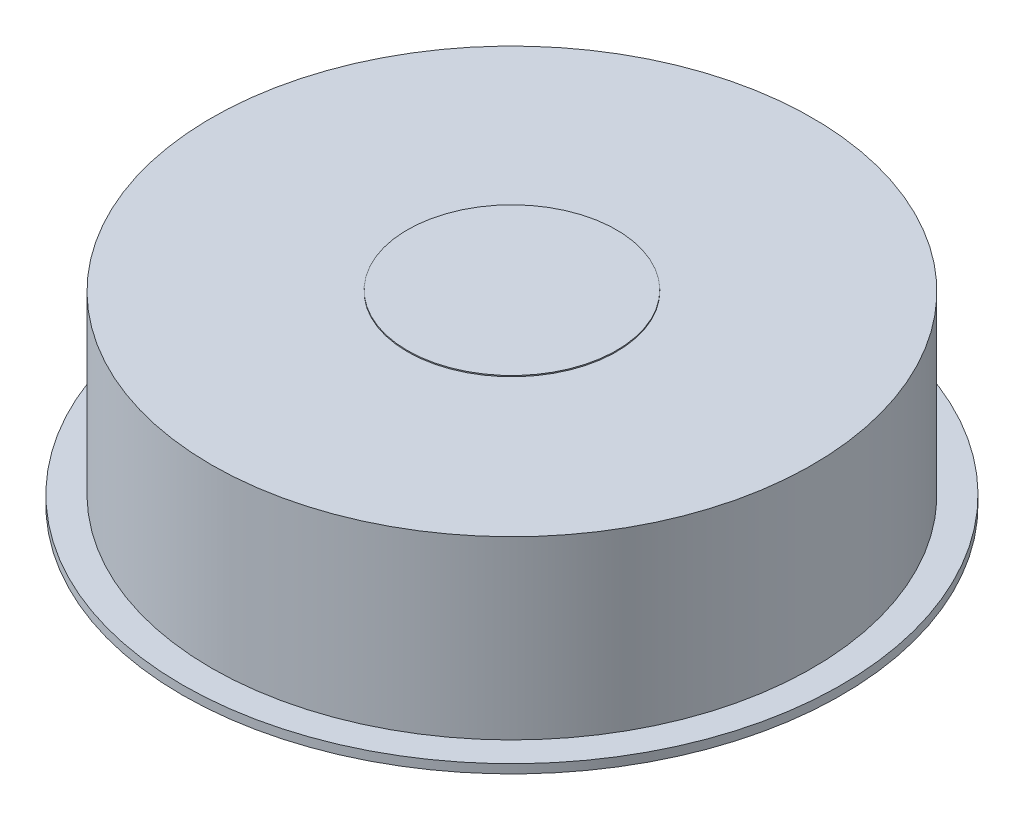
ISO-10303-21;
HEADER;
FILE_DESCRIPTION(('STEP AP214'),'2;1');
FILE_NAME('part.step','',(''),(''),'','','');
FILE_SCHEMA(('AUTOMOTIVE_DESIGN { 1 0 10303 214 1 1 1 1 }'));
ENDSEC;
DATA;
#1=APPLICATION_CONTEXT('core data for automotive mechanical design processes');
#2=APPLICATION_PROTOCOL_DEFINITION('international standard','automotive_design',2000,#1);
#3=PRODUCT_CONTEXT('',#1,'mechanical');
#4=PRODUCT('Part','Part','',(#3));
#5=PRODUCT_RELATED_PRODUCT_CATEGORY('part','',(#4));
#6=PRODUCT_DEFINITION_FORMATION('','',#4);
#7=PRODUCT_DEFINITION_CONTEXT('part definition',#1,'design');
#8=PRODUCT_DEFINITION('design','',#6,#7);
#9=PRODUCT_DEFINITION_SHAPE('','',#8);
#10=(LENGTH_UNIT() NAMED_UNIT(*) SI_UNIT(.MILLI.,.METRE.));
#11=(NAMED_UNIT(*) PLANE_ANGLE_UNIT() SI_UNIT($,.RADIAN.));
#12=(NAMED_UNIT(*) SI_UNIT($,.STERADIAN.) SOLID_ANGLE_UNIT());
#13=UNCERTAINTY_MEASURE_WITH_UNIT(LENGTH_MEASURE(1.E-05),#10,'distance_accuracy_value','');
#14=(GEOMETRIC_REPRESENTATION_CONTEXT(3) GLOBAL_UNCERTAINTY_ASSIGNED_CONTEXT((#13)) GLOBAL_UNIT_ASSIGNED_CONTEXT((#10,
#11,#12)) REPRESENTATION_CONTEXT('',''));
#15=CARTESIAN_POINT('',(0.,0.,0.));
#16=DIRECTION('',(0.,0.,1.));
#17=DIRECTION('',(1.,0.,0.));
#18=AXIS2_PLACEMENT_3D('',#15,#16,#17);
#19=CARTESIAN_POINT('',(0.,11.9141229966181,0.));
#20=DIRECTION('',(0.,-1.,0.));
#21=DIRECTION('',(0.,0.,-1.));
#22=AXIS2_PLACEMENT_3D('',#19,#20,#21);
#23=CYLINDRICAL_SURFACE('',#22,30.65);
#24=CARTESIAN_POINT('',(0.,11.9141229966181,0.));
#25=DIRECTION('',(0.,1.,0.));
#26=DIRECTION('',(0.,0.,1.));
#27=AXIS2_PLACEMENT_3D('',#24,#25,#26);
#28=CIRCLE('',#27,30.65);
#29=CARTESIAN_POINT('',(0.,11.9141229966181,30.65));
#30=VERTEX_POINT('',#29);
#31=EDGE_CURVE('E10',#30,#30,#28,.T.);
#32=ORIENTED_EDGE('',*,*,#31,.F.);
#33=EDGE_LOOP('',(#32));
#34=FACE_BOUND('',#33,.T.);
#35=CARTESIAN_POINT('',(0.,11.0891229966181,0.));
#36=DIRECTION('',(0.,1.,0.));
#37=DIRECTION('',(0.,0.,1.));
#38=AXIS2_PLACEMENT_3D('',#35,#36,#37);
#39=CIRCLE('',#38,30.65);
#40=CARTESIAN_POINT('',(0.,11.0891229966181,30.65));
#41=VERTEX_POINT('',#40);
#42=EDGE_CURVE('E48',#41,#41,#39,.T.);
#43=ORIENTED_EDGE('',*,*,#42,.T.);
#44=EDGE_LOOP('',(#43));
#45=FACE_BOUND('',#44,.T.);
#46=ADVANCED_FACE('F45',(#34,#45),#23,.T.);
#47=CARTESIAN_POINT('',(0.,11.9141229966181,0.));
#48=DIRECTION('',(0.,1.,0.));
#49=DIRECTION('',(0.,0.,1.));
#50=AXIS2_PLACEMENT_3D('',#47,#48,#49);
#51=PLANE('',#50);
#52=CARTESIAN_POINT('',(0.,11.9141229966181,0.));
#53=DIRECTION('',(0.,1.,0.));
#54=DIRECTION('',(0.,0.,1.));
#55=AXIS2_PLACEMENT_3D('',#52,#53,#54);
#56=CIRCLE('',#55,27.945);
#57=CARTESIAN_POINT('',(0.,11.9141229966181,27.945));
#58=VERTEX_POINT('',#57);
#59=EDGE_CURVE('E59',#58,#58,#56,.T.);
#60=ORIENTED_EDGE('',*,*,#59,.F.);
#61=EDGE_LOOP('',(#60));
#62=FACE_BOUND('',#61,.T.);
#63=ORIENTED_EDGE('',*,*,#31,.T.);
#64=EDGE_LOOP('',(#63));
#65=FACE_BOUND('',#64,.T.);
#66=ADVANCED_FACE('F106',(#62,#65),#51,.T.);
#67=CARTESIAN_POINT('',(0.,11.0891229966181,0.));
#68=DIRECTION('',(0.,1.,0.));
#69=DIRECTION('',(0.,0.,1.));
#70=AXIS2_PLACEMENT_3D('',#67,#68,#69);
#71=PLANE('',#70);
#72=CARTESIAN_POINT('',(0.,11.0891229966181,0.));
#73=DIRECTION('',(0.,-1.,0.));
#74=DIRECTION('',(0.,0.,-1.));
#75=AXIS2_PLACEMENT_3D('',#72,#73,#74);
#76=CIRCLE('',#75,25.43);
#77=CARTESIAN_POINT('',(0.,11.0891229966181,-25.43));
#78=VERTEX_POINT('',#77);
#79=EDGE_CURVE('E67',#78,#78,#76,.T.);
#80=ORIENTED_EDGE('',*,*,#79,.F.);
#81=EDGE_LOOP('',(#80));
#82=FACE_BOUND('',#81,.T.);
#83=ORIENTED_EDGE('',*,*,#42,.F.);
#84=EDGE_LOOP('',(#83));
#85=FACE_BOUND('',#84,.T.);
#86=ADVANCED_FACE('F102',(#82,#85),#71,.F.);
#87=CARTESIAN_POINT('',(0.,28.2816229966181,0.));
#88=DIRECTION('',(0.,-1.,0.));
#89=DIRECTION('',(0.,0.,-1.));
#90=AXIS2_PLACEMENT_3D('',#87,#88,#89);
#91=CYLINDRICAL_SURFACE('',#90,27.945);
#92=CARTESIAN_POINT('',(0.,28.2816229966181,0.));
#93=DIRECTION('',(0.,1.,0.));
#94=DIRECTION('',(0.,0.,1.));
#95=AXIS2_PLACEMENT_3D('',#92,#93,#94);
#96=CIRCLE('',#95,27.945);
#97=CARTESIAN_POINT('',(0.,28.2816229966181,27.945));
#98=VERTEX_POINT('',#97);
#99=EDGE_CURVE('E57',#98,#98,#96,.T.);
#100=ORIENTED_EDGE('',*,*,#99,.F.);
#101=EDGE_LOOP('',(#100));
#102=FACE_BOUND('',#101,.T.);
#103=ORIENTED_EDGE('',*,*,#59,.T.);
#104=EDGE_LOOP('',(#103));
#105=FACE_BOUND('',#104,.T.);
#106=ADVANCED_FACE('F96',(#102,#105),#91,.T.);
#107=CARTESIAN_POINT('',(0.,28.2816229966181,0.));
#108=DIRECTION('',(0.,1.,0.));
#109=DIRECTION('',(0.,0.,1.));
#110=AXIS2_PLACEMENT_3D('',#107,#108,#109);
#111=PLANE('',#110);
#112=CARTESIAN_POINT('',(0.,28.2816229966181,0.));
#113=DIRECTION('',(0.,1.,0.));
#114=DIRECTION('',(0.,0.,1.));
#115=AXIS2_PLACEMENT_3D('',#112,#113,#114);
#116=CIRCLE('',#115,9.725);
#117=CARTESIAN_POINT('',(0.,28.2816229966181,9.725));
#118=VERTEX_POINT('',#117);
#119=EDGE_CURVE('E75',#118,#118,#116,.T.);
#120=ORIENTED_EDGE('',*,*,#119,.F.);
#121=EDGE_LOOP('',(#120));
#122=FACE_BOUND('',#121,.T.);
#123=ORIENTED_EDGE('',*,*,#99,.T.);
#124=EDGE_LOOP('',(#123));
#125=FACE_BOUND('',#124,.T.);
#126=ADVANCED_FACE('F92',(#122,#125),#111,.T.);
#127=CARTESIAN_POINT('',(0.,18.2641229966181,0.));
#128=DIRECTION('',(0.,-1.,0.));
#129=DIRECTION('',(0.,0.,-1.));
#130=AXIS2_PLACEMENT_3D('',#127,#128,#129);
#131=CYLINDRICAL_SURFACE('',#130,25.43);
#132=CARTESIAN_POINT('',(0.,18.2641229966181,0.));
#133=DIRECTION('',(0.,-1.,0.));
#134=DIRECTION('',(0.,0.,-1.));
#135=AXIS2_PLACEMENT_3D('',#132,#133,#134);
#136=CIRCLE('',#135,25.43);
#137=CARTESIAN_POINT('',(0.,18.2641229966181,-25.43));
#138=VERTEX_POINT('',#137);
#139=EDGE_CURVE('E63',#138,#138,#136,.T.);
#140=ORIENTED_EDGE('',*,*,#139,.F.);
#141=EDGE_LOOP('',(#140));
#142=FACE_BOUND('',#141,.T.);
#143=ORIENTED_EDGE('',*,*,#79,.T.);
#144=EDGE_LOOP('',(#143));
#145=FACE_BOUND('',#144,.T.);
#146=ADVANCED_FACE('F95',(#142,#145),#131,.F.);
#147=CARTESIAN_POINT('',(0.,18.2641229966181,0.));
#148=DIRECTION('',(0.,-1.,0.));
#149=DIRECTION('',(0.,0.,-1.));
#150=AXIS2_PLACEMENT_3D('',#147,#148,#149);
#151=PLANE('',#150);
#152=ORIENTED_EDGE('',*,*,#139,.T.);
#153=EDGE_LOOP('',(#152));
#154=FACE_BOUND('',#153,.T.);
#155=ADVANCED_FACE('F88',(#154),#151,.T.);
#156=CARTESIAN_POINT('',(0.,28.3816229966181,0.));
#157=DIRECTION('',(0.,-1.,0.));
#158=DIRECTION('',(0.,0.,-1.));
#159=AXIS2_PLACEMENT_3D('',#156,#157,#158);
#160=CYLINDRICAL_SURFACE('',#159,9.725);
#161=CARTESIAN_POINT('',(0.,28.3816229966181,0.));
#162=DIRECTION('',(0.,1.,0.));
#163=DIRECTION('',(0.,0.,1.));
#164=AXIS2_PLACEMENT_3D('',#161,#162,#163);
#165=CIRCLE('',#164,9.725);
#166=CARTESIAN_POINT('',(0.,28.3816229966181,9.725));
#167=VERTEX_POINT('',#166);
#168=EDGE_CURVE('E71',#167,#167,#165,.T.);
#169=ORIENTED_EDGE('',*,*,#168,.F.);
#170=EDGE_LOOP('',(#169));
#171=FACE_BOUND('',#170,.T.);
#172=ORIENTED_EDGE('',*,*,#119,.T.);
#173=EDGE_LOOP('',(#172));
#174=FACE_BOUND('',#173,.T.);
#175=ADVANCED_FACE('F85',(#171,#174),#160,.T.);
#176=CARTESIAN_POINT('',(0.,28.3816229966181,0.));
#177=DIRECTION('',(0.,1.,0.));
#178=DIRECTION('',(0.,0.,1.));
#179=AXIS2_PLACEMENT_3D('',#176,#177,#178);
#180=PLANE('',#179);
#181=ORIENTED_EDGE('',*,*,#168,.T.);
#182=EDGE_LOOP('',(#181));
#183=FACE_BOUND('',#182,.T.);
#184=ADVANCED_FACE('F83',(#183),#180,.T.);
#185=CLOSED_SHELL('',(#46,#66,#86,#106,#126,#146,#155,#175,#184));
#186=MANIFOLD_SOLID_BREP('B2',#185);
#187=ADVANCED_BREP_SHAPE_REPRESENTATION('',(#18,#186),#14);
#188=SHAPE_DEFINITION_REPRESENTATION(#9,#187);
ENDSEC;
END-ISO-10303-21;
